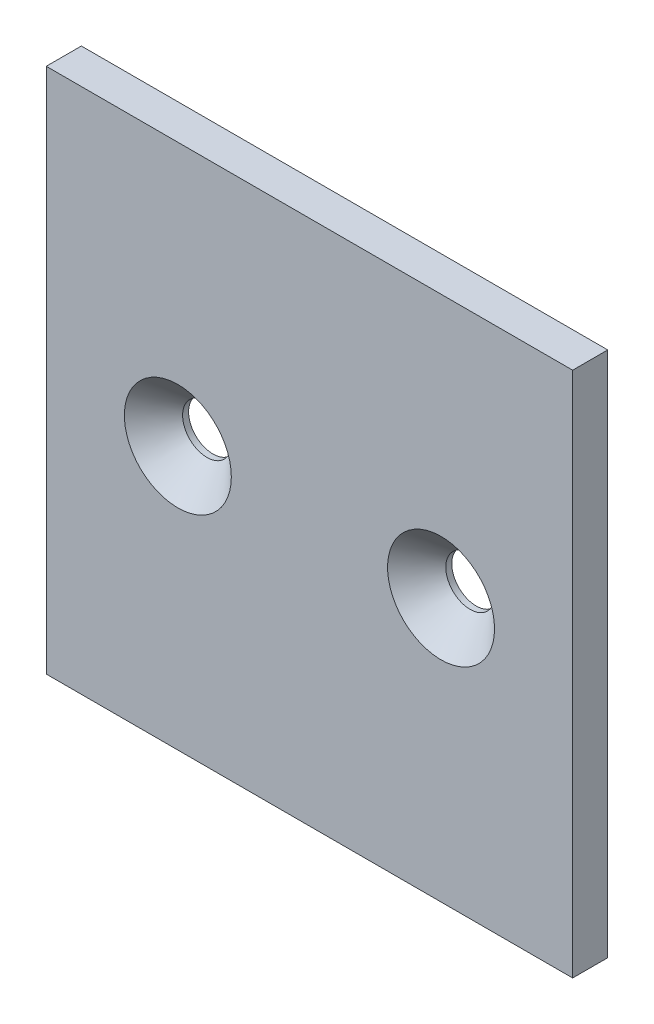
ISO-10303-21;
HEADER;
FILE_DESCRIPTION(('STEP AP214'),'2;1');
FILE_NAME('part.step','',(''),(''),'','','');
FILE_SCHEMA(('AUTOMOTIVE_DESIGN { 1 0 10303 214 1 1 1 1 }'));
ENDSEC;
DATA;
#1=APPLICATION_CONTEXT('core data for automotive mechanical design processes');
#2=APPLICATION_PROTOCOL_DEFINITION('international standard','automotive_design',2000,#1);
#3=PRODUCT_CONTEXT('',#1,'mechanical');
#4=PRODUCT('Part','Part','',(#3));
#5=PRODUCT_RELATED_PRODUCT_CATEGORY('part','',(#4));
#6=PRODUCT_DEFINITION_FORMATION('','',#4);
#7=PRODUCT_DEFINITION_CONTEXT('part definition',#1,'design');
#8=PRODUCT_DEFINITION('design','',#6,#7);
#9=PRODUCT_DEFINITION_SHAPE('','',#8);
#10=(LENGTH_UNIT() NAMED_UNIT(*) SI_UNIT(.MILLI.,.METRE.));
#11=(NAMED_UNIT(*) PLANE_ANGLE_UNIT() SI_UNIT($,.RADIAN.));
#12=(NAMED_UNIT(*) SI_UNIT($,.STERADIAN.) SOLID_ANGLE_UNIT());
#13=UNCERTAINTY_MEASURE_WITH_UNIT(LENGTH_MEASURE(1.E-05),#10,'distance_accuracy_value','');
#14=(GEOMETRIC_REPRESENTATION_CONTEXT(3) GLOBAL_UNCERTAINTY_ASSIGNED_CONTEXT((#13)) GLOBAL_UNIT_ASSIGNED_CONTEXT((#10,
#11,#12)) REPRESENTATION_CONTEXT('',''));
#15=CARTESIAN_POINT('',(0.,0.,0.));
#16=DIRECTION('',(0.,0.,1.));
#17=DIRECTION('',(1.,0.,0.));
#18=AXIS2_PLACEMENT_3D('',#15,#16,#17);
#19=CARTESIAN_POINT('',(0.,0.,3.));
#20=DIRECTION('',(0.,0.,-1.));
#21=DIRECTION('',(-1.,0.,0.));
#22=AXIS2_PLACEMENT_3D('',#19,#20,#21);
#23=PLANE('',#22);
#24=CARTESIAN_POINT('',(67.5,45.,3.));
#25=DIRECTION('',(0.,0.,1.));
#26=DIRECTION('',(1.,0.,0.));
#27=AXIS2_PLACEMENT_3D('',#24,#25,#26);
#28=CIRCLE('',#27,9.144);
#29=CARTESIAN_POINT('',(76.644,45.,3.));
#30=VERTEX_POINT('',#29);
#31=EDGE_CURVE('E119',#30,#30,#28,.T.);
#32=ORIENTED_EDGE('',*,*,#31,.F.);
#33=EDGE_LOOP('',(#32));
#34=FACE_BOUND('',#33,.T.);
#35=CARTESIAN_POINT('',(22.5,45.,3.));
#36=DIRECTION('',(0.,0.,1.));
#37=DIRECTION('',(1.,0.,0.));
#38=AXIS2_PLACEMENT_3D('',#35,#36,#37);
#39=CIRCLE('',#38,9.144);
#40=CARTESIAN_POINT('',(31.644,45.,3.));
#41=VERTEX_POINT('',#40);
#42=EDGE_CURVE('E109',#41,#41,#39,.T.);
#43=ORIENTED_EDGE('',*,*,#42,.F.);
#44=EDGE_LOOP('',(#43));
#45=FACE_BOUND('',#44,.T.);
#46=DIRECTION('',(1.,0.,0.));
#47=VECTOR('',#46,1.);
#48=CARTESIAN_POINT('',(90.,0.,3.));
#49=LINE('',#48,#47);
#50=CARTESIAN_POINT('',(0.,0.,3.));
#51=VERTEX_POINT('',#50);
#52=CARTESIAN_POINT('',(90.,0.,3.));
#53=VERTEX_POINT('',#52);
#54=EDGE_CURVE('E85',#51,#53,#49,.T.);
#55=ORIENTED_EDGE('',*,*,#54,.T.);
#56=DIRECTION('',(0.,1.,0.));
#57=VECTOR('',#56,1.);
#58=CARTESIAN_POINT('',(90.,90.,3.));
#59=LINE('',#58,#57);
#60=CARTESIAN_POINT('',(90.,90.,3.));
#61=VERTEX_POINT('',#60);
#62=EDGE_CURVE('E81',#53,#61,#59,.T.);
#63=ORIENTED_EDGE('',*,*,#62,.T.);
#64=DIRECTION('',(-1.,0.,0.));
#65=VECTOR('',#64,1.);
#66=CARTESIAN_POINT('',(90.,90.,3.));
#67=LINE('',#66,#65);
#68=CARTESIAN_POINT('',(0.,90.,3.));
#69=VERTEX_POINT('',#68);
#70=EDGE_CURVE('E83',#61,#69,#67,.T.);
#71=ORIENTED_EDGE('',*,*,#70,.T.);
#72=DIRECTION('',(0.,-1.,0.));
#73=VECTOR('',#72,1.);
#74=CARTESIAN_POINT('',(0.,0.,3.));
#75=LINE('',#74,#73);
#76=EDGE_CURVE('E51',#69,#51,#75,.T.);
#77=ORIENTED_EDGE('',*,*,#76,.T.);
#78=EDGE_LOOP('',(#55,#63,#71,#77));
#79=FACE_BOUND('',#78,.T.);
#80=ADVANCED_FACE('F32',(#34,#45,#79),#23,.F.);
#81=CARTESIAN_POINT('',(0.,0.,-3.));
#82=DIRECTION('',(0.,0.,-1.));
#83=DIRECTION('',(-1.,0.,0.));
#84=AXIS2_PLACEMENT_3D('',#81,#82,#83);
#85=PLANE('',#84);
#86=CARTESIAN_POINT('',(22.5,45.,-3.));
#87=DIRECTION('',(0.,0.,1.));
#88=DIRECTION('',(1.,0.,0.));
#89=AXIS2_PLACEMENT_3D('',#86,#87,#88);
#90=CIRCLE('',#89,4.1656);
#91=CARTESIAN_POINT('',(26.6656,45.,-3.));
#92=VERTEX_POINT('',#91);
#93=EDGE_CURVE('E101',#92,#92,#90,.T.);
#94=ORIENTED_EDGE('',*,*,#93,.T.);
#95=EDGE_LOOP('',(#94));
#96=FACE_BOUND('',#95,.T.);
#97=DIRECTION('',(1.,0.,0.));
#98=VECTOR('',#97,1.);
#99=CARTESIAN_POINT('',(90.,0.,-3.));
#100=LINE('',#99,#98);
#101=CARTESIAN_POINT('',(0.,0.,-3.));
#102=VERTEX_POINT('',#101);
#103=CARTESIAN_POINT('',(90.,0.,-3.));
#104=VERTEX_POINT('',#103);
#105=EDGE_CURVE('E98',#102,#104,#100,.T.);
#106=ORIENTED_EDGE('',*,*,#105,.F.);
#107=DIRECTION('',(0.,-1.,0.));
#108=VECTOR('',#107,1.);
#109=CARTESIAN_POINT('',(0.,0.,-3.));
#110=LINE('',#109,#108);
#111=CARTESIAN_POINT('',(0.,90.,-3.));
#112=VERTEX_POINT('',#111);
#113=EDGE_CURVE('E74',#112,#102,#110,.T.);
#114=ORIENTED_EDGE('',*,*,#113,.F.);
#115=DIRECTION('',(-1.,0.,0.));
#116=VECTOR('',#115,1.);
#117=CARTESIAN_POINT('',(90.,90.,-3.));
#118=LINE('',#117,#116);
#119=CARTESIAN_POINT('',(90.,90.,-3.));
#120=VERTEX_POINT('',#119);
#121=EDGE_CURVE('E68',#120,#112,#118,.T.);
#122=ORIENTED_EDGE('',*,*,#121,.F.);
#123=DIRECTION('',(0.,1.,0.));
#124=VECTOR('',#123,1.);
#125=CARTESIAN_POINT('',(90.,90.,-3.));
#126=LINE('',#125,#124);
#127=EDGE_CURVE('E89',#104,#120,#126,.T.);
#128=ORIENTED_EDGE('',*,*,#127,.F.);
#129=EDGE_LOOP('',(#106,#114,#122,#128));
#130=FACE_BOUND('',#129,.T.);
#131=CARTESIAN_POINT('',(67.5,45.,-3.));
#132=DIRECTION('',(0.,0.,1.));
#133=DIRECTION('',(1.,0.,0.));
#134=AXIS2_PLACEMENT_3D('',#131,#132,#133);
#135=CIRCLE('',#134,4.1656);
#136=CARTESIAN_POINT('',(71.6656,45.,-3.));
#137=VERTEX_POINT('',#136);
#138=EDGE_CURVE('E108',#137,#137,#135,.T.);
#139=ORIENTED_EDGE('',*,*,#138,.T.);
#140=EDGE_LOOP('',(#139));
#141=FACE_BOUND('',#140,.T.);
#142=ADVANCED_FACE('F125',(#96,#130,#141),#85,.T.);
#143=CARTESIAN_POINT('',(90.,0.,3.));
#144=DIRECTION('',(0.,1.,0.));
#145=DIRECTION('',(-1.,0.,0.));
#146=AXIS2_PLACEMENT_3D('',#143,#144,#145);
#147=PLANE('',#146);
#148=ORIENTED_EDGE('',*,*,#105,.T.);
#149=DIRECTION('',(0.,0.,-1.));
#150=VECTOR('',#149,1.);
#151=CARTESIAN_POINT('',(90.,0.,3.));
#152=LINE('',#151,#150);
#153=EDGE_CURVE('E11',#53,#104,#152,.T.);
#154=ORIENTED_EDGE('',*,*,#153,.F.);
#155=ORIENTED_EDGE('',*,*,#54,.F.);
#156=DIRECTION('',(0.,0.,-1.));
#157=VECTOR('',#156,1.);
#158=CARTESIAN_POINT('',(0.,0.,3.));
#159=LINE('',#158,#157);
#160=EDGE_CURVE('E94',#51,#102,#159,.T.);
#161=ORIENTED_EDGE('',*,*,#160,.T.);
#162=EDGE_LOOP('',(#148,#154,#155,#161));
#163=FACE_BOUND('',#162,.T.);
#164=ADVANCED_FACE('F34',(#163),#147,.F.);
#165=CARTESIAN_POINT('',(90.,90.,3.));
#166=DIRECTION('',(-1.,0.,0.));
#167=DIRECTION('',(0.,-1.,0.));
#168=AXIS2_PLACEMENT_3D('',#165,#166,#167);
#169=PLANE('',#168);
#170=ORIENTED_EDGE('',*,*,#127,.T.);
#171=DIRECTION('',(0.,0.,-1.));
#172=VECTOR('',#171,1.);
#173=CARTESIAN_POINT('',(90.,90.,3.));
#174=LINE('',#173,#172);
#175=EDGE_CURVE('E42',#61,#120,#174,.T.);
#176=ORIENTED_EDGE('',*,*,#175,.F.);
#177=ORIENTED_EDGE('',*,*,#62,.F.);
#178=ORIENTED_EDGE('',*,*,#153,.T.);
#179=EDGE_LOOP('',(#170,#176,#177,#178));
#180=FACE_BOUND('',#179,.T.);
#181=ADVANCED_FACE('F88',(#180),#169,.F.);
#182=CARTESIAN_POINT('',(90.,90.,3.));
#183=DIRECTION('',(0.,-1.,0.));
#184=DIRECTION('',(0.,0.,-1.));
#185=AXIS2_PLACEMENT_3D('',#182,#183,#184);
#186=PLANE('',#185);
#187=ORIENTED_EDGE('',*,*,#121,.T.);
#188=DIRECTION('',(0.,0.,-1.));
#189=VECTOR('',#188,1.);
#190=CARTESIAN_POINT('',(0.,90.,3.));
#191=LINE('',#190,#189);
#192=EDGE_CURVE('E90',#69,#112,#191,.T.);
#193=ORIENTED_EDGE('',*,*,#192,.F.);
#194=ORIENTED_EDGE('',*,*,#70,.F.);
#195=ORIENTED_EDGE('',*,*,#175,.T.);
#196=EDGE_LOOP('',(#187,#193,#194,#195));
#197=FACE_BOUND('',#196,.T.);
#198=ADVANCED_FACE('F92',(#197),#186,.F.);
#199=CARTESIAN_POINT('',(0.,0.,3.));
#200=DIRECTION('',(1.,0.,0.));
#201=DIRECTION('',(0.,0.,-1.));
#202=AXIS2_PLACEMENT_3D('',#199,#200,#201);
#203=PLANE('',#202);
#204=ORIENTED_EDGE('',*,*,#113,.T.);
#205=ORIENTED_EDGE('',*,*,#160,.F.);
#206=ORIENTED_EDGE('',*,*,#76,.F.);
#207=ORIENTED_EDGE('',*,*,#192,.T.);
#208=EDGE_LOOP('',(#204,#205,#206,#207));
#209=FACE_BOUND('',#208,.T.);
#210=ADVANCED_FACE('F131',(#209),#203,.F.);
#211=CARTESIAN_POINT('',(22.5,45.,3.));
#212=DIRECTION('',(0.,0.,-1.));
#213=DIRECTION('',(-1.,0.,0.));
#214=AXIS2_PLACEMENT_3D('',#211,#212,#213);
#215=CYLINDRICAL_SURFACE('',#214,4.1656);
#216=CARTESIAN_POINT('',(22.5,45.,-1.97839999999998));
#217=DIRECTION('',(0.,0.,1.));
#218=DIRECTION('',(1.,0.,0.));
#219=AXIS2_PLACEMENT_3D('',#216,#217,#218);
#220=CIRCLE('',#219,4.1656);
#221=CARTESIAN_POINT('',(26.6656,45.,-1.97839999999998));
#222=VERTEX_POINT('',#221);
#223=EDGE_CURVE('E106',#222,#222,#220,.F.);
#224=ORIENTED_EDGE('',*,*,#223,.F.);
#225=EDGE_LOOP('',(#224));
#226=FACE_BOUND('',#225,.T.);
#227=ORIENTED_EDGE('',*,*,#93,.F.);
#228=EDGE_LOOP('',(#227));
#229=FACE_BOUND('',#228,.T.);
#230=ADVANCED_FACE('F128',(#226,#229),#215,.F.);
#231=CARTESIAN_POINT('',(67.5,45.,3.));
#232=DIRECTION('',(0.,0.,-1.));
#233=DIRECTION('',(-1.,0.,0.));
#234=AXIS2_PLACEMENT_3D('',#231,#232,#233);
#235=CYLINDRICAL_SURFACE('',#234,4.1656);
#236=CARTESIAN_POINT('',(67.5,45.,-1.97839999999999));
#237=DIRECTION('',(0.,0.,1.));
#238=DIRECTION('',(1.,0.,0.));
#239=AXIS2_PLACEMENT_3D('',#236,#237,#238);
#240=CIRCLE('',#239,4.1656);
#241=CARTESIAN_POINT('',(71.6656,45.,-1.97839999999999));
#242=VERTEX_POINT('',#241);
#243=EDGE_CURVE('E36',#242,#242,#240,.F.);
#244=ORIENTED_EDGE('',*,*,#243,.F.);
#245=EDGE_LOOP('',(#244));
#246=FACE_BOUND('',#245,.T.);
#247=ORIENTED_EDGE('',*,*,#138,.F.);
#248=EDGE_LOOP('',(#247));
#249=FACE_BOUND('',#248,.T.);
#250=ADVANCED_FACE('F130',(#246,#249),#235,.F.);
#251=CARTESIAN_POINT('',(22.5,45.,3.));
#252=DIRECTION('',(0.,0.,1.));
#253=DIRECTION('',(1.,0.,0.));
#254=AXIS2_PLACEMENT_3D('',#251,#252,#253);
#255=CONICAL_SURFACE('',#254,9.144,0.78539816339745);
#256=ORIENTED_EDGE('',*,*,#223,.T.);
#257=EDGE_LOOP('',(#256));
#258=FACE_BOUND('',#257,.T.);
#259=ORIENTED_EDGE('',*,*,#42,.T.);
#260=EDGE_LOOP('',(#259));
#261=FACE_BOUND('',#260,.T.);
#262=ADVANCED_FACE('F138',(#258,#261),#255,.F.);
#263=CARTESIAN_POINT('',(67.5,45.,3.));
#264=DIRECTION('',(0.,0.,1.));
#265=DIRECTION('',(1.,0.,0.));
#266=AXIS2_PLACEMENT_3D('',#263,#264,#265);
#267=CONICAL_SURFACE('',#266,9.144,0.78539816339745);
#268=ORIENTED_EDGE('',*,*,#243,.T.);
#269=EDGE_LOOP('',(#268));
#270=FACE_BOUND('',#269,.T.);
#271=ORIENTED_EDGE('',*,*,#31,.T.);
#272=EDGE_LOOP('',(#271));
#273=FACE_BOUND('',#272,.T.);
#274=ADVANCED_FACE('F206',(#270,#273),#267,.F.);
#275=CLOSED_SHELL('',(#80,#142,#164,#181,#198,#210,#230,#250,#262,#274));
#276=MANIFOLD_SOLID_BREP('B2',#275);
#277=ADVANCED_BREP_SHAPE_REPRESENTATION('',(#18,#276),#14);
#278=SHAPE_DEFINITION_REPRESENTATION(#9,#277);
ENDSEC;
END-ISO-10303-21;
